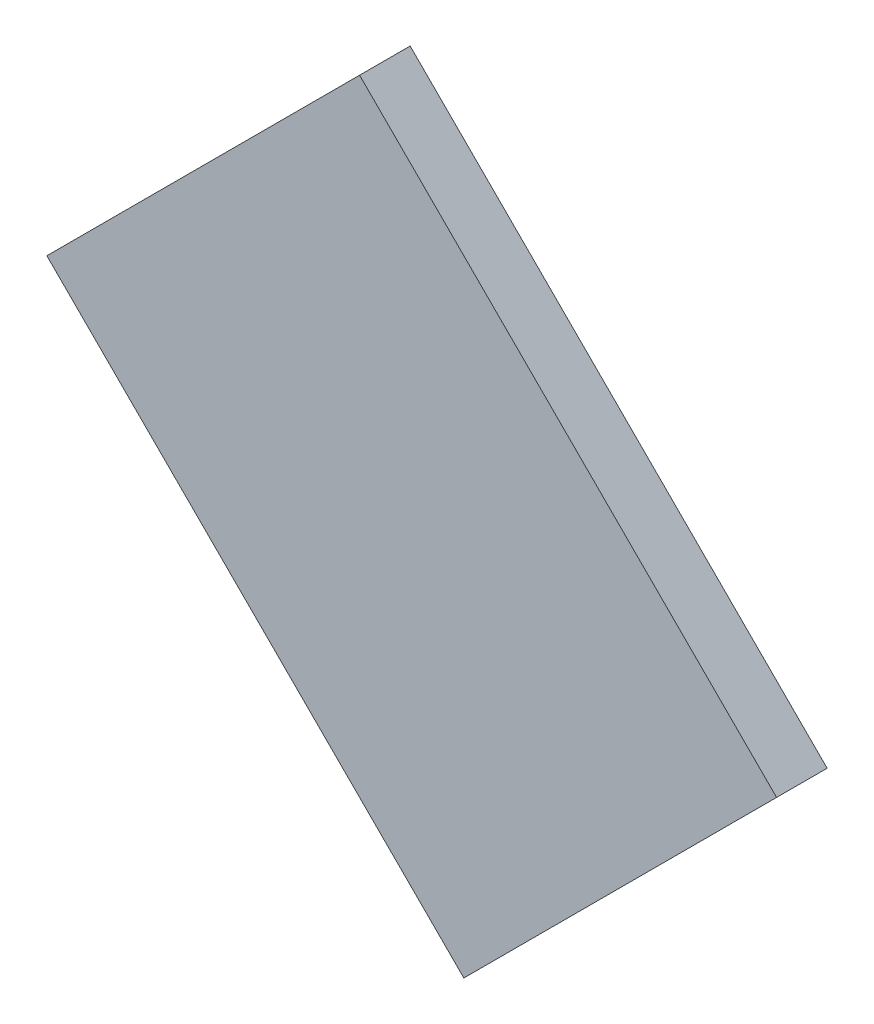
ISO-10303-21;
HEADER;
FILE_DESCRIPTION(('STEP AP214'),'2;1');
FILE_NAME('part.step','',(''),(''),'','','');
FILE_SCHEMA(('AUTOMOTIVE_DESIGN { 1 0 10303 214 1 1 1 1 }'));
ENDSEC;
DATA;
#1=APPLICATION_CONTEXT('core data for automotive mechanical design processes');
#2=APPLICATION_PROTOCOL_DEFINITION('international standard','automotive_design',2000,#1);
#3=PRODUCT_CONTEXT('',#1,'mechanical');
#4=PRODUCT('Part','Part','',(#3));
#5=PRODUCT_RELATED_PRODUCT_CATEGORY('part','',(#4));
#6=PRODUCT_DEFINITION_FORMATION('','',#4);
#7=PRODUCT_DEFINITION_CONTEXT('part definition',#1,'design');
#8=PRODUCT_DEFINITION('design','',#6,#7);
#9=PRODUCT_DEFINITION_SHAPE('','',#8);
#10=(LENGTH_UNIT() NAMED_UNIT(*) SI_UNIT(.MILLI.,.METRE.));
#11=(NAMED_UNIT(*) PLANE_ANGLE_UNIT() SI_UNIT($,.RADIAN.));
#12=(NAMED_UNIT(*) SI_UNIT($,.STERADIAN.) SOLID_ANGLE_UNIT());
#13=UNCERTAINTY_MEASURE_WITH_UNIT(LENGTH_MEASURE(1.E-05),#10,'distance_accuracy_value','');
#14=(GEOMETRIC_REPRESENTATION_CONTEXT(3) GLOBAL_UNCERTAINTY_ASSIGNED_CONTEXT((#13)) GLOBAL_UNIT_ASSIGNED_CONTEXT((#10,
#11,#12)) REPRESENTATION_CONTEXT('',''));
#15=CARTESIAN_POINT('',(0.,0.,0.));
#16=DIRECTION('',(0.,0.,1.));
#17=DIRECTION('',(1.,0.,0.));
#18=AXIS2_PLACEMENT_3D('',#15,#16,#17);
#19=CARTESIAN_POINT('',(3.4123453335,9.9401453335,0.76487));
#20=DIRECTION('',(0.,0.,-1.));
#21=DIRECTION('',(0.,1.,0.));
#22=AXIS2_PLACEMENT_3D('',#19,#20,#21);
#23=PLANE('',#22);
#24=DIRECTION('',(0.707106781186548,0.707106781186548,0.));
#25=VECTOR('',#24,1.);
#26=CARTESIAN_POINT('',(3.164858,9.975500667,0.76487));
#27=LINE('',#26,#25);
#28=CARTESIAN_POINT('',(3.164858,9.975500667,0.76487));
#29=VERTEX_POINT('',#28);
#30=CARTESIAN_POINT('',(3.37699,10.187632667,0.76487));
#31=VERTEX_POINT('',#30);
#32=EDGE_CURVE('E55',#29,#31,#27,.T.);
#33=ORIENTED_EDGE('',*,*,#32,.T.);
#34=DIRECTION('',(0.707106781186548,-0.707106781186548,0.));
#35=VECTOR('',#34,1.);
#36=CARTESIAN_POINT('',(3.37699,10.187632667,0.76487));
#37=LINE('',#36,#35);
#38=CARTESIAN_POINT('',(3.659832667,9.90479,0.76487));
#39=VERTEX_POINT('',#38);
#40=EDGE_CURVE('E57',#31,#39,#37,.T.);
#41=ORIENTED_EDGE('',*,*,#40,.T.);
#42=DIRECTION('',(-0.707106781186548,-0.707106781186548,0.));
#43=VECTOR('',#42,1.);
#44=CARTESIAN_POINT('',(3.659832667,9.90479,0.76487));
#45=LINE('',#44,#43);
#46=CARTESIAN_POINT('',(3.447700667,9.692658,0.76487));
#47=VERTEX_POINT('',#46);
#48=EDGE_CURVE('E20',#39,#47,#45,.T.);
#49=ORIENTED_EDGE('',*,*,#48,.T.);
#50=DIRECTION('',(-0.707106781186548,0.707106781186548,0.));
#51=VECTOR('',#50,1.);
#52=CARTESIAN_POINT('',(3.447700667,9.692658,0.76487));
#53=LINE('',#52,#51);
#54=EDGE_CURVE('E80',#47,#29,#53,.T.);
#55=ORIENTED_EDGE('',*,*,#54,.T.);
#56=EDGE_LOOP('',(#33,#41,#49,#55));
#57=FACE_BOUND('',#56,.T.);
#58=ADVANCED_FACE('F17',(#57),#23,.T.);
#59=CARTESIAN_POINT('',(3.659832667,9.90479,0.76487));
#60=DIRECTION('',(-0.707106781186548,0.707106781186548,0.));
#61=DIRECTION('',(-0.707106781186548,-0.707106781186548,0.));
#62=AXIS2_PLACEMENT_3D('',#59,#60,#61);
#63=PLANE('',#62);
#64=DIRECTION('',(0.,0.,1.));
#65=VECTOR('',#64,1.);
#66=CARTESIAN_POINT('',(3.447700667,9.692658,0.76487));
#67=LINE('',#66,#65);
#68=CARTESIAN_POINT('',(3.447700667,9.692658,0.79916));
#69=VERTEX_POINT('',#68);
#70=EDGE_CURVE('E68',#69,#47,#67,.F.);
#71=ORIENTED_EDGE('',*,*,#70,.T.);
#72=ORIENTED_EDGE('',*,*,#48,.F.);
#73=DIRECTION('',(0.,0.,1.));
#74=VECTOR('',#73,1.);
#75=CARTESIAN_POINT('',(3.659832667,9.90479,0.76487));
#76=LINE('',#75,#74);
#77=CARTESIAN_POINT('',(3.659832667,9.90479,0.79916));
#78=VERTEX_POINT('',#77);
#79=EDGE_CURVE('E63',#39,#78,#76,.T.);
#80=ORIENTED_EDGE('',*,*,#79,.T.);
#81=DIRECTION('',(0.707106781186547,0.707106781186548,0.));
#82=VECTOR('',#81,1.);
#83=CARTESIAN_POINT('',(3.447700667,9.692658,0.79916));
#84=LINE('',#83,#82);
#85=EDGE_CURVE('E83',#69,#78,#84,.T.);
#86=ORIENTED_EDGE('',*,*,#85,.F.);
#87=EDGE_LOOP('',(#71,#72,#80,#86));
#88=FACE_BOUND('',#87,.T.);
#89=ADVANCED_FACE('F65',(#88),#63,.F.);
#90=CARTESIAN_POINT('',(3.37699,10.187632667,0.76487));
#91=DIRECTION('',(-0.707106781186548,-0.707106781186548,0.));
#92=DIRECTION('',(0.707106781186548,-0.707106781186548,0.));
#93=AXIS2_PLACEMENT_3D('',#90,#91,#92);
#94=PLANE('',#93);
#95=ORIENTED_EDGE('',*,*,#79,.F.);
#96=ORIENTED_EDGE('',*,*,#40,.F.);
#97=DIRECTION('',(0.,0.,1.));
#98=VECTOR('',#97,1.);
#99=CARTESIAN_POINT('',(3.37699,10.187632667,0.76487));
#100=LINE('',#99,#98);
#101=CARTESIAN_POINT('',(3.37699,10.187632667,0.79916));
#102=VERTEX_POINT('',#101);
#103=EDGE_CURVE('E75',#31,#102,#100,.T.);
#104=ORIENTED_EDGE('',*,*,#103,.T.);
#105=DIRECTION('',(-0.707106781186546,0.707106781186549,0.));
#106=VECTOR('',#105,1.);
#107=CARTESIAN_POINT('',(3.659832667,9.90479,0.79916));
#108=LINE('',#107,#106);
#109=EDGE_CURVE('E72',#78,#102,#108,.T.);
#110=ORIENTED_EDGE('',*,*,#109,.F.);
#111=EDGE_LOOP('',(#95,#96,#104,#110));
#112=FACE_BOUND('',#111,.T.);
#113=ADVANCED_FACE('F70',(#112),#94,.F.);
#114=CARTESIAN_POINT('',(3.164858,9.975500667,0.76487));
#115=DIRECTION('',(0.707106781186548,-0.707106781186548,0.));
#116=DIRECTION('',(0.707106781186548,0.707106781186548,0.));
#117=AXIS2_PLACEMENT_3D('',#114,#115,#116);
#118=PLANE('',#117);
#119=ORIENTED_EDGE('',*,*,#103,.F.);
#120=ORIENTED_EDGE('',*,*,#32,.F.);
#121=DIRECTION('',(0.,0.,1.));
#122=VECTOR('',#121,1.);
#123=CARTESIAN_POINT('',(3.164858,9.975500667,0.76487));
#124=LINE('',#123,#122);
#125=CARTESIAN_POINT('',(3.164858,9.975500667,0.79916));
#126=VERTEX_POINT('',#125);
#127=EDGE_CURVE('E35',#29,#126,#124,.T.);
#128=ORIENTED_EDGE('',*,*,#127,.T.);
#129=DIRECTION('',(-0.707106781186547,-0.707106781186548,0.));
#130=VECTOR('',#129,1.);
#131=CARTESIAN_POINT('',(3.37699,10.187632667,0.79916));
#132=LINE('',#131,#130);
#133=EDGE_CURVE('E26',#102,#126,#132,.T.);
#134=ORIENTED_EDGE('',*,*,#133,.F.);
#135=EDGE_LOOP('',(#119,#120,#128,#134));
#136=FACE_BOUND('',#135,.T.);
#137=ADVANCED_FACE('F89',(#136),#118,.F.);
#138=CARTESIAN_POINT('',(3.447700667,9.692658,0.76487));
#139=DIRECTION('',(0.707106781186548,0.707106781186548,0.));
#140=DIRECTION('',(-0.707106781186548,0.707106781186548,0.));
#141=AXIS2_PLACEMENT_3D('',#138,#139,#140);
#142=PLANE('',#141);
#143=ORIENTED_EDGE('',*,*,#127,.F.);
#144=ORIENTED_EDGE('',*,*,#54,.F.);
#145=ORIENTED_EDGE('',*,*,#70,.F.);
#146=DIRECTION('',(0.707106781186546,-0.707106781186549,0.));
#147=VECTOR('',#146,1.);
#148=CARTESIAN_POINT('',(3.164858,9.975500667,0.79916));
#149=LINE('',#148,#147);
#150=EDGE_CURVE('E11',#126,#69,#149,.T.);
#151=ORIENTED_EDGE('',*,*,#150,.F.);
#152=EDGE_LOOP('',(#143,#144,#145,#151));
#153=FACE_BOUND('',#152,.T.);
#154=ADVANCED_FACE('F91',(#153),#142,.F.);
#155=CARTESIAN_POINT('',(3.4123453335,9.9401453335,0.79916));
#156=DIRECTION('',(0.,0.,1.));
#157=DIRECTION('',(0.,-1.,0.));
#158=AXIS2_PLACEMENT_3D('',#155,#156,#157);
#159=PLANE('',#158);
#160=ORIENTED_EDGE('',*,*,#133,.T.);
#161=ORIENTED_EDGE('',*,*,#150,.T.);
#162=ORIENTED_EDGE('',*,*,#85,.T.);
#163=ORIENTED_EDGE('',*,*,#109,.T.);
#164=EDGE_LOOP('',(#160,#161,#162,#163));
#165=FACE_BOUND('',#164,.T.);
#166=ADVANCED_FACE('F88',(#165),#159,.T.);
#167=CLOSED_SHELL('',(#58,#89,#113,#137,#154,#166));
#168=MANIFOLD_SOLID_BREP('B1',#167);
#169=ADVANCED_BREP_SHAPE_REPRESENTATION('',(#18,#168),#14);
#170=SHAPE_DEFINITION_REPRESENTATION(#9,#169);
ENDSEC;
END-ISO-10303-21;
